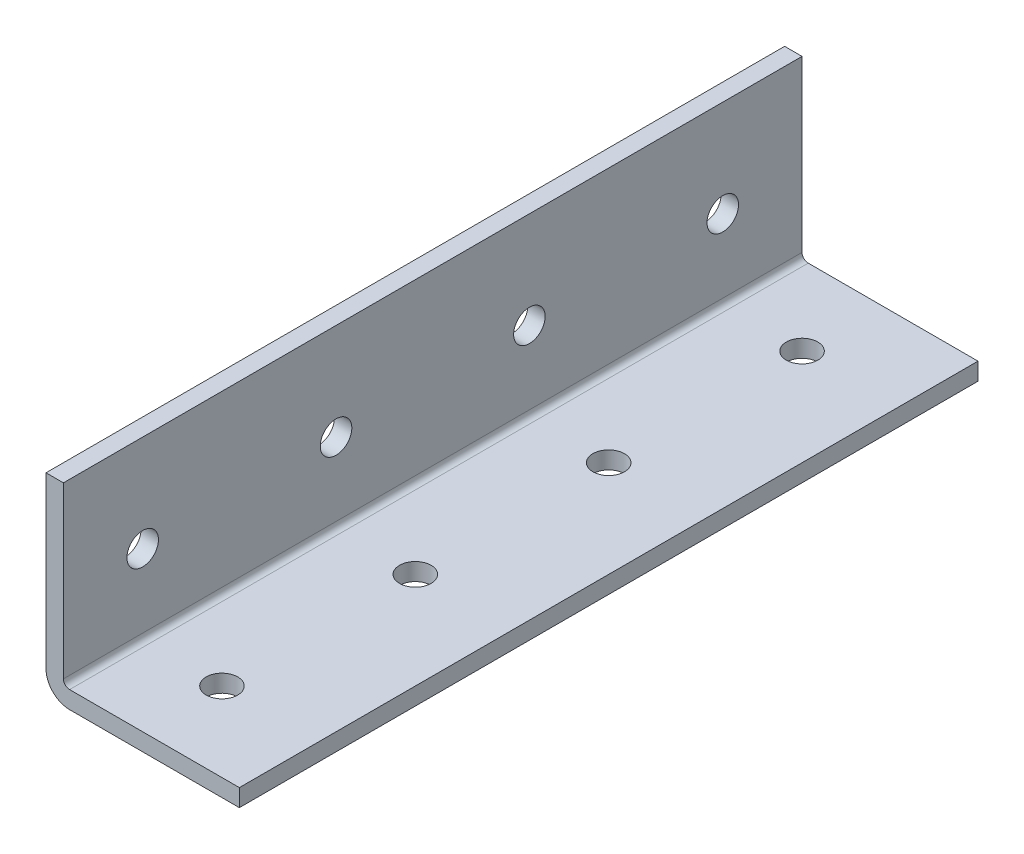
ISO-10303-21;
HEADER;
FILE_DESCRIPTION(('STEP AP214'),'2;1');
FILE_NAME('part.step','',(''),(''),'','','');
FILE_SCHEMA(('AUTOMOTIVE_DESIGN { 1 0 10303 214 1 1 1 1 }'));
ENDSEC;
DATA;
#1=APPLICATION_CONTEXT('core data for automotive mechanical design processes');
#2=APPLICATION_PROTOCOL_DEFINITION('international standard','automotive_design',2000,#1);
#3=PRODUCT_CONTEXT('',#1,'mechanical');
#4=PRODUCT('Part','Part','',(#3));
#5=PRODUCT_RELATED_PRODUCT_CATEGORY('part','',(#4));
#6=PRODUCT_DEFINITION_FORMATION('','',#4);
#7=PRODUCT_DEFINITION_CONTEXT('part definition',#1,'design');
#8=PRODUCT_DEFINITION('design','',#6,#7);
#9=PRODUCT_DEFINITION_SHAPE('','',#8);
#10=(LENGTH_UNIT() NAMED_UNIT(*) SI_UNIT(.MILLI.,.METRE.));
#11=(NAMED_UNIT(*) PLANE_ANGLE_UNIT() SI_UNIT($,.RADIAN.));
#12=(NAMED_UNIT(*) SI_UNIT($,.STERADIAN.) SOLID_ANGLE_UNIT());
#13=UNCERTAINTY_MEASURE_WITH_UNIT(LENGTH_MEASURE(1.E-05),#10,'distance_accuracy_value','');
#14=(GEOMETRIC_REPRESENTATION_CONTEXT(3) GLOBAL_UNCERTAINTY_ASSIGNED_CONTEXT((#13)) GLOBAL_UNIT_ASSIGNED_CONTEXT((#10,
#11,#12)) REPRESENTATION_CONTEXT('',''));
#15=CARTESIAN_POINT('',(0.,0.,0.));
#16=DIRECTION('',(0.,0.,1.));
#17=DIRECTION('',(1.,0.,0.));
#18=AXIS2_PLACEMENT_3D('',#15,#16,#17);
#19=CARTESIAN_POINT('',(25.4,0.,-749.3));
#20=DIRECTION('',(0.,-1.,0.));
#21=DIRECTION('',(0.,0.,-1.));
#22=AXIS2_PLACEMENT_3D('',#19,#20,#21);
#23=PLANE('',#22);
#24=CARTESIAN_POINT('',(12.7,0.,-660.4));
#25=DIRECTION('',(0.,-1.,0.));
#26=DIRECTION('',(0.,0.,-1.));
#27=AXIS2_PLACEMENT_3D('',#24,#25,#26);
#28=CIRCLE('',#27,2.07009999999995);
#29=CARTESIAN_POINT('',(12.7,0.,-662.4701));
#30=VERTEX_POINT('',#29);
#31=EDGE_CURVE('E184',#30,#30,#28,.T.);
#32=ORIENTED_EDGE('',*,*,#31,.F.);
#33=EDGE_LOOP('',(#32));
#34=FACE_BOUND('',#33,.T.);
#35=CARTESIAN_POINT('',(12.7,0.,-685.8));
#36=DIRECTION('',(0.,-1.,0.));
#37=DIRECTION('',(0.,0.,-1.));
#38=AXIS2_PLACEMENT_3D('',#35,#36,#37);
#39=CIRCLE('',#38,2.07009999999995);
#40=CARTESIAN_POINT('',(12.7,0.,-687.8701));
#41=VERTEX_POINT('',#40);
#42=EDGE_CURVE('E178',#41,#41,#39,.T.);
#43=ORIENTED_EDGE('',*,*,#42,.F.);
#44=EDGE_LOOP('',(#43));
#45=FACE_BOUND('',#44,.T.);
#46=CARTESIAN_POINT('',(12.7,0.,-711.2));
#47=DIRECTION('',(0.,-1.,0.));
#48=DIRECTION('',(0.,0.,-1.));
#49=AXIS2_PLACEMENT_3D('',#46,#47,#48);
#50=CIRCLE('',#49,2.07009999999995);
#51=CARTESIAN_POINT('',(12.7,0.,-713.2701));
#52=VERTEX_POINT('',#51);
#53=EDGE_CURVE('E172',#52,#52,#50,.T.);
#54=ORIENTED_EDGE('',*,*,#53,.F.);
#55=EDGE_LOOP('',(#54));
#56=FACE_BOUND('',#55,.T.);
#57=CARTESIAN_POINT('',(12.7,0.,-736.6));
#58=DIRECTION('',(0.,-1.,0.));
#59=DIRECTION('',(0.,0.,-1.));
#60=AXIS2_PLACEMENT_3D('',#57,#58,#59);
#61=CIRCLE('',#60,2.07009999999995);
#62=CARTESIAN_POINT('',(12.7,0.,-738.6701));
#63=VERTEX_POINT('',#62);
#64=EDGE_CURVE('E168',#63,#63,#61,.T.);
#65=ORIENTED_EDGE('',*,*,#64,.F.);
#66=EDGE_LOOP('',(#65));
#67=FACE_BOUND('',#66,.T.);
#68=DIRECTION('',(0.,0.,1.));
#69=VECTOR('',#68,1.);
#70=CARTESIAN_POINT('',(3.0988,0.,-749.3));
#71=LINE('',#70,#69);
#72=CARTESIAN_POINT('',(3.0988,0.,-649.986));
#73=VERTEX_POINT('',#72);
#74=CARTESIAN_POINT('',(3.0988,0.,-747.014));
#75=VERTEX_POINT('',#74);
#76=EDGE_CURVE('E111',#73,#75,#71,.F.);
#77=ORIENTED_EDGE('',*,*,#76,.T.);
#78=DIRECTION('',(1.,0.,0.));
#79=VECTOR('',#78,1.);
#80=CARTESIAN_POINT('',(25.4,0.,-747.014));
#81=LINE('',#80,#79);
#82=CARTESIAN_POINT('',(25.4,0.,-747.014));
#83=VERTEX_POINT('',#82);
#84=EDGE_CURVE('E50',#75,#83,#81,.T.);
#85=ORIENTED_EDGE('',*,*,#84,.T.);
#86=DIRECTION('',(0.,0.,1.));
#87=VECTOR('',#86,1.);
#88=CARTESIAN_POINT('',(25.4,0.,-749.3));
#89=LINE('',#88,#87);
#90=CARTESIAN_POINT('',(25.4,0.,-649.986));
#91=VERTEX_POINT('',#90);
#92=EDGE_CURVE('E127',#83,#91,#89,.T.);
#93=ORIENTED_EDGE('',*,*,#92,.T.);
#94=DIRECTION('',(1.,0.,0.));
#95=VECTOR('',#94,1.);
#96=CARTESIAN_POINT('',(25.4,0.,-649.986));
#97=LINE('',#96,#95);
#98=EDGE_CURVE('E122',#73,#91,#97,.T.);
#99=ORIENTED_EDGE('',*,*,#98,.F.);
#100=EDGE_LOOP('',(#77,#85,#93,#99));
#101=FACE_BOUND('',#100,.T.);
#102=ADVANCED_FACE('F35',(#34,#45,#56,#67,#101),#23,.T.);
#103=CARTESIAN_POINT('',(25.4,25.4,749.3));
#104=DIRECTION('',(0.,1.,0.));
#105=DIRECTION('',(0.,0.,1.));
#106=AXIS2_PLACEMENT_3D('',#103,#104,#105);
#107=PLANE('',#106);
#108=DIRECTION('',(0.,0.,-1.));
#109=VECTOR('',#108,1.);
#110=CARTESIAN_POINT('',(2.286,25.4,749.3));
#111=LINE('',#110,#109);
#112=CARTESIAN_POINT('',(2.286,25.4,-649.986));
#113=VERTEX_POINT('',#112);
#114=CARTESIAN_POINT('',(2.286,25.4,-747.014));
#115=VERTEX_POINT('',#114);
#116=EDGE_CURVE('E191',#113,#115,#111,.T.);
#117=ORIENTED_EDGE('',*,*,#116,.T.);
#118=DIRECTION('',(-1.,0.,0.));
#119=VECTOR('',#118,1.);
#120=CARTESIAN_POINT('',(25.4,25.4,-747.014));
#121=LINE('',#120,#119);
#122=CARTESIAN_POINT('',(0.,25.4000000000002,-747.014));
#123=VERTEX_POINT('',#122);
#124=EDGE_CURVE('E108',#115,#123,#121,.T.);
#125=ORIENTED_EDGE('',*,*,#124,.T.);
#126=DIRECTION('',(0.,0.,-1.));
#127=VECTOR('',#126,1.);
#128=CARTESIAN_POINT('',(0.,25.4,749.3));
#129=LINE('',#128,#127);
#130=CARTESIAN_POINT('',(0.,25.4000000000002,-649.986));
#131=VERTEX_POINT('',#130);
#132=EDGE_CURVE('E107',#131,#123,#129,.T.);
#133=ORIENTED_EDGE('',*,*,#132,.F.);
#134=DIRECTION('',(-1.,0.,0.));
#135=VECTOR('',#134,1.);
#136=CARTESIAN_POINT('',(25.4,25.4,-649.986));
#137=LINE('',#136,#135);
#138=EDGE_CURVE('E129',#113,#131,#137,.T.);
#139=ORIENTED_EDGE('',*,*,#138,.F.);
#140=EDGE_LOOP('',(#117,#125,#133,#139));
#141=FACE_BOUND('',#140,.T.);
#142=ADVANCED_FACE('F221',(#141),#107,.T.);
#143=CARTESIAN_POINT('',(25.4,0.,0.));
#144=DIRECTION('',(-1.,0.,0.));
#145=DIRECTION('',(0.,0.,1.));
#146=AXIS2_PLACEMENT_3D('',#143,#144,#145);
#147=PLANE('',#146);
#148=DIRECTION('',(0.,-1.,0.));
#149=VECTOR('',#148,1.);
#150=CARTESIAN_POINT('',(25.4,0.,-747.014));
#151=LINE('',#150,#149);
#152=CARTESIAN_POINT('',(25.4,2.286,-747.014));
#153=VERTEX_POINT('',#152);
#154=EDGE_CURVE('E213',#153,#83,#151,.T.);
#155=ORIENTED_EDGE('',*,*,#154,.F.);
#156=DIRECTION('',(0.,0.,-1.));
#157=VECTOR('',#156,1.);
#158=CARTESIAN_POINT('',(25.4,2.286,749.3));
#159=LINE('',#158,#157);
#160=CARTESIAN_POINT('',(25.4,2.286,-649.986));
#161=VERTEX_POINT('',#160);
#162=EDGE_CURVE('E190',#161,#153,#159,.T.);
#163=ORIENTED_EDGE('',*,*,#162,.F.);
#164=DIRECTION('',(0.,-1.,0.));
#165=VECTOR('',#164,1.);
#166=CARTESIAN_POINT('',(25.4,0.,-649.986));
#167=LINE('',#166,#165);
#168=EDGE_CURVE('E132',#161,#91,#167,.T.);
#169=ORIENTED_EDGE('',*,*,#168,.T.);
#170=ORIENTED_EDGE('',*,*,#92,.F.);
#171=EDGE_LOOP('',(#155,#163,#169,#170));
#172=FACE_BOUND('',#171,.T.);
#173=ADVANCED_FACE('F229',(#172),#147,.F.);
#174=CARTESIAN_POINT('',(0.,0.,0.));
#175=DIRECTION('',(-1.,0.,0.));
#176=DIRECTION('',(0.,0.,1.));
#177=AXIS2_PLACEMENT_3D('',#174,#175,#176);
#178=PLANE('',#177);
#179=CARTESIAN_POINT('',(0.,12.7,-736.6));
#180=DIRECTION('',(-1.,0.,0.));
#181=DIRECTION('',(0.,0.,1.));
#182=AXIS2_PLACEMENT_3D('',#179,#180,#181);
#183=CIRCLE('',#182,2.07009999999995);
#184=CARTESIAN_POINT('',(0.,12.7,-734.5299));
#185=VERTEX_POINT('',#184);
#186=EDGE_CURVE('E162',#185,#185,#183,.T.);
#187=ORIENTED_EDGE('',*,*,#186,.F.);
#188=EDGE_LOOP('',(#187));
#189=FACE_BOUND('',#188,.T.);
#190=CARTESIAN_POINT('',(0.,12.7,-711.2));
#191=DIRECTION('',(-1.,0.,0.));
#192=DIRECTION('',(0.,0.,1.));
#193=AXIS2_PLACEMENT_3D('',#190,#191,#192);
#194=CIRCLE('',#193,2.07009999999995);
#195=CARTESIAN_POINT('',(0.,12.7,-709.1299));
#196=VERTEX_POINT('',#195);
#197=EDGE_CURVE('E156',#196,#196,#194,.T.);
#198=ORIENTED_EDGE('',*,*,#197,.F.);
#199=EDGE_LOOP('',(#198));
#200=FACE_BOUND('',#199,.T.);
#201=CARTESIAN_POINT('',(0.,12.7,-685.8));
#202=DIRECTION('',(-1.,0.,0.));
#203=DIRECTION('',(0.,0.,1.));
#204=AXIS2_PLACEMENT_3D('',#201,#202,#203);
#205=CIRCLE('',#204,2.07009999999995);
#206=CARTESIAN_POINT('',(0.,12.7,-683.7299));
#207=VERTEX_POINT('',#206);
#208=EDGE_CURVE('E150',#207,#207,#205,.T.);
#209=ORIENTED_EDGE('',*,*,#208,.F.);
#210=EDGE_LOOP('',(#209));
#211=FACE_BOUND('',#210,.T.);
#212=CARTESIAN_POINT('',(0.,12.7,-660.4));
#213=DIRECTION('',(-1.,0.,0.));
#214=DIRECTION('',(0.,0.,1.));
#215=AXIS2_PLACEMENT_3D('',#212,#213,#214);
#216=CIRCLE('',#215,2.07009999999995);
#217=CARTESIAN_POINT('',(0.,12.7,-658.3299));
#218=VERTEX_POINT('',#217);
#219=EDGE_CURVE('E144',#218,#218,#216,.T.);
#220=ORIENTED_EDGE('',*,*,#219,.F.);
#221=EDGE_LOOP('',(#220));
#222=FACE_BOUND('',#221,.T.);
#223=ORIENTED_EDGE('',*,*,#132,.T.);
#224=DIRECTION('',(0.,-1.,0.));
#225=VECTOR('',#224,1.);
#226=CARTESIAN_POINT('',(0.,0.,-747.014));
#227=LINE('',#226,#225);
#228=CARTESIAN_POINT('',(0.,3.0988,-747.014));
#229=VERTEX_POINT('',#228);
#230=EDGE_CURVE('E99',#123,#229,#227,.T.);
#231=ORIENTED_EDGE('',*,*,#230,.T.);
#232=DIRECTION('',(0.,0.,1.));
#233=VECTOR('',#232,1.);
#234=CARTESIAN_POINT('',(0.,3.0988,0.));
#235=LINE('',#234,#233);
#236=CARTESIAN_POINT('',(0.,3.0988,-649.986));
#237=VERTEX_POINT('',#236);
#238=EDGE_CURVE('E57',#229,#237,#235,.T.);
#239=ORIENTED_EDGE('',*,*,#238,.T.);
#240=DIRECTION('',(0.,-1.,0.));
#241=VECTOR('',#240,1.);
#242=CARTESIAN_POINT('',(0.,0.,-649.986));
#243=LINE('',#242,#241);
#244=EDGE_CURVE('E124',#131,#237,#243,.T.);
#245=ORIENTED_EDGE('',*,*,#244,.F.);
#246=EDGE_LOOP('',(#223,#231,#239,#245));
#247=FACE_BOUND('',#246,.T.);
#248=ADVANCED_FACE('F105',(#189,#200,#211,#222,#247),#178,.T.);
#249=CARTESIAN_POINT('',(2.286,2.286,749.3));
#250=DIRECTION('',(-1.,0.,0.));
#251=DIRECTION('',(0.,0.,1.));
#252=AXIS2_PLACEMENT_3D('',#249,#250,#251);
#253=PLANE('',#252);
#254=CARTESIAN_POINT('',(2.286,12.7,-736.6));
#255=DIRECTION('',(-1.,0.,0.));
#256=DIRECTION('',(0.,0.,1.));
#257=AXIS2_PLACEMENT_3D('',#254,#255,#256);
#258=CIRCLE('',#257,2.07009999999995);
#259=CARTESIAN_POINT('',(2.286,12.7,-734.5299));
#260=VERTEX_POINT('',#259);
#261=EDGE_CURVE('E165',#260,#260,#258,.T.);
#262=ORIENTED_EDGE('',*,*,#261,.T.);
#263=EDGE_LOOP('',(#262));
#264=FACE_BOUND('',#263,.T.);
#265=CARTESIAN_POINT('',(2.286,12.7,-711.2));
#266=DIRECTION('',(-1.,0.,0.));
#267=DIRECTION('',(0.,0.,1.));
#268=AXIS2_PLACEMENT_3D('',#265,#266,#267);
#269=CIRCLE('',#268,2.07009999999995);
#270=CARTESIAN_POINT('',(2.286,12.7,-709.1299));
#271=VERTEX_POINT('',#270);
#272=EDGE_CURVE('E159',#271,#271,#269,.T.);
#273=ORIENTED_EDGE('',*,*,#272,.T.);
#274=EDGE_LOOP('',(#273));
#275=FACE_BOUND('',#274,.T.);
#276=CARTESIAN_POINT('',(2.286,12.7,-685.8));
#277=DIRECTION('',(-1.,0.,0.));
#278=DIRECTION('',(0.,0.,1.));
#279=AXIS2_PLACEMENT_3D('',#276,#277,#278);
#280=CIRCLE('',#279,2.07009999999995);
#281=CARTESIAN_POINT('',(2.286,12.7,-683.7299));
#282=VERTEX_POINT('',#281);
#283=EDGE_CURVE('E153',#282,#282,#280,.T.);
#284=ORIENTED_EDGE('',*,*,#283,.T.);
#285=EDGE_LOOP('',(#284));
#286=FACE_BOUND('',#285,.T.);
#287=CARTESIAN_POINT('',(2.286,12.7,-660.4));
#288=DIRECTION('',(-1.,0.,0.));
#289=DIRECTION('',(0.,0.,1.));
#290=AXIS2_PLACEMENT_3D('',#287,#288,#289);
#291=CIRCLE('',#290,2.07009999999995);
#292=CARTESIAN_POINT('',(2.286,12.7,-658.3299));
#293=VERTEX_POINT('',#292);
#294=EDGE_CURVE('E147',#293,#293,#291,.T.);
#295=ORIENTED_EDGE('',*,*,#294,.T.);
#296=EDGE_LOOP('',(#295));
#297=FACE_BOUND('',#296,.T.);
#298=DIRECTION('',(0.,-1.,0.));
#299=VECTOR('',#298,1.);
#300=CARTESIAN_POINT('',(2.286,2.286,-747.014));
#301=LINE('',#300,#299);
#302=CARTESIAN_POINT('',(2.286,3.0988,-747.014));
#303=VERTEX_POINT('',#302);
#304=EDGE_CURVE('E205',#115,#303,#301,.T.);
#305=ORIENTED_EDGE('',*,*,#304,.F.);
#306=ORIENTED_EDGE('',*,*,#116,.F.);
#307=DIRECTION('',(0.,-1.,0.));
#308=VECTOR('',#307,1.);
#309=CARTESIAN_POINT('',(2.286,2.286,-649.986));
#310=LINE('',#309,#308);
#311=CARTESIAN_POINT('',(2.286,3.0988,-649.986));
#312=VERTEX_POINT('',#311);
#313=EDGE_CURVE('E128',#113,#312,#310,.T.);
#314=ORIENTED_EDGE('',*,*,#313,.T.);
#315=DIRECTION('',(0.,0.,-1.));
#316=VECTOR('',#315,1.);
#317=CARTESIAN_POINT('',(2.286,3.0988,-749.3));
#318=LINE('',#317,#316);
#319=EDGE_CURVE('E115',#312,#303,#318,.T.);
#320=ORIENTED_EDGE('',*,*,#319,.T.);
#321=EDGE_LOOP('',(#305,#306,#314,#320));
#322=FACE_BOUND('',#321,.T.);
#323=ADVANCED_FACE('F203',(#264,#275,#286,#297,#322),#253,.F.);
#324=CARTESIAN_POINT('',(25.4,2.286,749.3));
#325=DIRECTION('',(0.,-1.,0.));
#326=DIRECTION('',(0.,0.,-1.));
#327=AXIS2_PLACEMENT_3D('',#324,#325,#326);
#328=PLANE('',#327);
#329=CARTESIAN_POINT('',(12.7,2.286,-660.4));
#330=DIRECTION('',(0.,-1.,0.));
#331=DIRECTION('',(0.,0.,-1.));
#332=AXIS2_PLACEMENT_3D('',#329,#330,#331);
#333=CIRCLE('',#332,2.07009999999995);
#334=CARTESIAN_POINT('',(12.7,2.286,-662.4701));
#335=VERTEX_POINT('',#334);
#336=EDGE_CURVE('E187',#335,#335,#333,.T.);
#337=ORIENTED_EDGE('',*,*,#336,.T.);
#338=EDGE_LOOP('',(#337));
#339=FACE_BOUND('',#338,.T.);
#340=CARTESIAN_POINT('',(12.7,2.286,-685.8));
#341=DIRECTION('',(0.,-1.,0.));
#342=DIRECTION('',(0.,0.,-1.));
#343=AXIS2_PLACEMENT_3D('',#340,#341,#342);
#344=CIRCLE('',#343,2.07009999999995);
#345=CARTESIAN_POINT('',(12.7,2.286,-687.8701));
#346=VERTEX_POINT('',#345);
#347=EDGE_CURVE('E181',#346,#346,#344,.T.);
#348=ORIENTED_EDGE('',*,*,#347,.T.);
#349=EDGE_LOOP('',(#348));
#350=FACE_BOUND('',#349,.T.);
#351=CARTESIAN_POINT('',(12.7,2.286,-711.2));
#352=DIRECTION('',(0.,-1.,0.));
#353=DIRECTION('',(0.,0.,-1.));
#354=AXIS2_PLACEMENT_3D('',#351,#352,#353);
#355=CIRCLE('',#354,2.07009999999995);
#356=CARTESIAN_POINT('',(12.7,2.286,-713.2701));
#357=VERTEX_POINT('',#356);
#358=EDGE_CURVE('E175',#357,#357,#355,.T.);
#359=ORIENTED_EDGE('',*,*,#358,.T.);
#360=EDGE_LOOP('',(#359));
#361=FACE_BOUND('',#360,.T.);
#362=CARTESIAN_POINT('',(12.7,2.286,-736.6));
#363=DIRECTION('',(0.,-1.,0.));
#364=DIRECTION('',(0.,0.,-1.));
#365=AXIS2_PLACEMENT_3D('',#362,#363,#364);
#366=CIRCLE('',#365,2.07009999999995);
#367=CARTESIAN_POINT('',(12.7,2.286,-738.6701));
#368=VERTEX_POINT('',#367);
#369=EDGE_CURVE('E171',#368,#368,#366,.T.);
#370=ORIENTED_EDGE('',*,*,#369,.T.);
#371=EDGE_LOOP('',(#370));
#372=FACE_BOUND('',#371,.T.);
#373=DIRECTION('',(1.,0.,0.));
#374=VECTOR('',#373,1.);
#375=CARTESIAN_POINT('',(25.4,2.286,-747.014));
#376=LINE('',#375,#374);
#377=CARTESIAN_POINT('',(3.0988,2.286,-747.014));
#378=VERTEX_POINT('',#377);
#379=EDGE_CURVE('E212',#378,#153,#376,.T.);
#380=ORIENTED_EDGE('',*,*,#379,.F.);
#381=DIRECTION('',(0.,0.,-1.));
#382=VECTOR('',#381,1.);
#383=CARTESIAN_POINT('',(3.0988,2.286,749.3));
#384=LINE('',#383,#382);
#385=CARTESIAN_POINT('',(3.0988,2.286,-649.986));
#386=VERTEX_POINT('',#385);
#387=EDGE_CURVE('E112',#378,#386,#384,.F.);
#388=ORIENTED_EDGE('',*,*,#387,.T.);
#389=DIRECTION('',(1.,0.,0.));
#390=VECTOR('',#389,1.);
#391=CARTESIAN_POINT('',(25.4,2.286,-649.986));
#392=LINE('',#391,#390);
#393=EDGE_CURVE('E141',#386,#161,#392,.T.);
#394=ORIENTED_EDGE('',*,*,#393,.T.);
#395=ORIENTED_EDGE('',*,*,#162,.T.);
#396=EDGE_LOOP('',(#380,#388,#394,#395));
#397=FACE_BOUND('',#396,.T.);
#398=ADVANCED_FACE('F226',(#339,#350,#361,#372,#397),#328,.F.);
#399=CARTESIAN_POINT('',(3.0988,3.0988,749.3));
#400=DIRECTION('',(0.,0.,1.));
#401=DIRECTION('',(1.,0.,0.));
#402=AXIS2_PLACEMENT_3D('',#399,#400,#401);
#403=CYLINDRICAL_SURFACE('',#402,0.8128);
#404=CARTESIAN_POINT('',(3.0988,3.0988,-747.014));
#405=DIRECTION('',(0.,0.,-1.));
#406=DIRECTION('',(-1.,0.,0.));
#407=AXIS2_PLACEMENT_3D('',#404,#405,#406);
#408=CIRCLE('',#407,0.8128);
#409=EDGE_CURVE('E210',#303,#378,#408,.F.);
#410=ORIENTED_EDGE('',*,*,#409,.F.);
#411=ORIENTED_EDGE('',*,*,#319,.F.);
#412=CARTESIAN_POINT('',(3.0988,3.0988,-649.986));
#413=DIRECTION('',(0.,0.,-1.));
#414=DIRECTION('',(-1.,0.,0.));
#415=AXIS2_PLACEMENT_3D('',#412,#413,#414);
#416=CIRCLE('',#415,0.8128);
#417=EDGE_CURVE('E138',#312,#386,#416,.F.);
#418=ORIENTED_EDGE('',*,*,#417,.T.);
#419=ORIENTED_EDGE('',*,*,#387,.F.);
#420=EDGE_LOOP('',(#410,#411,#418,#419));
#421=FACE_BOUND('',#420,.T.);
#422=ADVANCED_FACE('F208',(#421),#403,.F.);
#423=CARTESIAN_POINT('',(3.0988,3.0988,0.));
#424=DIRECTION('',(0.,0.,1.));
#425=DIRECTION('',(1.,0.,0.));
#426=AXIS2_PLACEMENT_3D('',#423,#424,#425);
#427=CYLINDRICAL_SURFACE('',#426,3.0988);
#428=ORIENTED_EDGE('',*,*,#238,.F.);
#429=CARTESIAN_POINT('',(3.0988,3.0988,-747.014));
#430=DIRECTION('',(0.,0.,-1.));
#431=DIRECTION('',(-1.,0.,0.));
#432=AXIS2_PLACEMENT_3D('',#429,#430,#431);
#433=CIRCLE('',#432,3.0988);
#434=EDGE_CURVE('E11',#229,#75,#433,.F.);
#435=ORIENTED_EDGE('',*,*,#434,.T.);
#436=ORIENTED_EDGE('',*,*,#76,.F.);
#437=CARTESIAN_POINT('',(3.0988,3.0988,-649.986));
#438=DIRECTION('',(0.,0.,-1.));
#439=DIRECTION('',(-1.,0.,0.));
#440=AXIS2_PLACEMENT_3D('',#437,#438,#439);
#441=CIRCLE('',#440,3.0988);
#442=EDGE_CURVE('E43',#237,#73,#441,.F.);
#443=ORIENTED_EDGE('',*,*,#442,.F.);
#444=EDGE_LOOP('',(#428,#435,#436,#443));
#445=FACE_BOUND('',#444,.T.);
#446=ADVANCED_FACE('F37',(#445),#427,.T.);
#447=CARTESIAN_POINT('',(12.7,0.,-660.4));
#448=DIRECTION('',(0.,-1.,0.));
#449=DIRECTION('',(0.,0.,-1.));
#450=AXIS2_PLACEMENT_3D('',#447,#448,#449);
#451=CYLINDRICAL_SURFACE('',#450,2.07009999999995);
#452=ORIENTED_EDGE('',*,*,#31,.T.);
#453=EDGE_LOOP('',(#452));
#454=FACE_BOUND('',#453,.T.);
#455=ORIENTED_EDGE('',*,*,#336,.F.);
#456=EDGE_LOOP('',(#455));
#457=FACE_BOUND('',#456,.T.);
#458=ADVANCED_FACE('F253',(#454,#457),#451,.F.);
#459=CARTESIAN_POINT('',(12.7,0.,-685.8));
#460=DIRECTION('',(0.,-1.,0.));
#461=DIRECTION('',(0.,0.,-1.));
#462=AXIS2_PLACEMENT_3D('',#459,#460,#461);
#463=CYLINDRICAL_SURFACE('',#462,2.07009999999995);
#464=ORIENTED_EDGE('',*,*,#42,.T.);
#465=EDGE_LOOP('',(#464));
#466=FACE_BOUND('',#465,.T.);
#467=ORIENTED_EDGE('',*,*,#347,.F.);
#468=EDGE_LOOP('',(#467));
#469=FACE_BOUND('',#468,.T.);
#470=ADVANCED_FACE('F264',(#466,#469),#463,.F.);
#471=CARTESIAN_POINT('',(12.7,0.,-711.2));
#472=DIRECTION('',(0.,-1.,0.));
#473=DIRECTION('',(0.,0.,-1.));
#474=AXIS2_PLACEMENT_3D('',#471,#472,#473);
#475=CYLINDRICAL_SURFACE('',#474,2.07009999999995);
#476=ORIENTED_EDGE('',*,*,#53,.T.);
#477=EDGE_LOOP('',(#476));
#478=FACE_BOUND('',#477,.T.);
#479=ORIENTED_EDGE('',*,*,#358,.F.);
#480=EDGE_LOOP('',(#479));
#481=FACE_BOUND('',#480,.T.);
#482=ADVANCED_FACE('F268',(#478,#481),#475,.F.);
#483=CARTESIAN_POINT('',(12.7,0.,-736.6));
#484=DIRECTION('',(0.,-1.,0.));
#485=DIRECTION('',(0.,0.,-1.));
#486=AXIS2_PLACEMENT_3D('',#483,#484,#485);
#487=CYLINDRICAL_SURFACE('',#486,2.07009999999995);
#488=ORIENTED_EDGE('',*,*,#64,.T.);
#489=EDGE_LOOP('',(#488));
#490=FACE_BOUND('',#489,.T.);
#491=ORIENTED_EDGE('',*,*,#369,.F.);
#492=EDGE_LOOP('',(#491));
#493=FACE_BOUND('',#492,.T.);
#494=ADVANCED_FACE('F272',(#490,#493),#487,.F.);
#495=CARTESIAN_POINT('',(0.,12.7,-736.6));
#496=DIRECTION('',(-1.,0.,0.));
#497=DIRECTION('',(0.,0.,1.));
#498=AXIS2_PLACEMENT_3D('',#495,#496,#497);
#499=CYLINDRICAL_SURFACE('',#498,2.07009999999995);
#500=ORIENTED_EDGE('',*,*,#186,.T.);
#501=EDGE_LOOP('',(#500));
#502=FACE_BOUND('',#501,.T.);
#503=ORIENTED_EDGE('',*,*,#261,.F.);
#504=EDGE_LOOP('',(#503));
#505=FACE_BOUND('',#504,.T.);
#506=ADVANCED_FACE('F276',(#502,#505),#499,.F.);
#507=CARTESIAN_POINT('',(0.,12.7,-711.2));
#508=DIRECTION('',(-1.,0.,0.));
#509=DIRECTION('',(0.,0.,1.));
#510=AXIS2_PLACEMENT_3D('',#507,#508,#509);
#511=CYLINDRICAL_SURFACE('',#510,2.07009999999995);
#512=ORIENTED_EDGE('',*,*,#197,.T.);
#513=EDGE_LOOP('',(#512));
#514=FACE_BOUND('',#513,.T.);
#515=ORIENTED_EDGE('',*,*,#272,.F.);
#516=EDGE_LOOP('',(#515));
#517=FACE_BOUND('',#516,.T.);
#518=ADVANCED_FACE('F280',(#514,#517),#511,.F.);
#519=CARTESIAN_POINT('',(0.,12.7,-685.8));
#520=DIRECTION('',(-1.,0.,0.));
#521=DIRECTION('',(0.,0.,1.));
#522=AXIS2_PLACEMENT_3D('',#519,#520,#521);
#523=CYLINDRICAL_SURFACE('',#522,2.07009999999995);
#524=ORIENTED_EDGE('',*,*,#208,.T.);
#525=EDGE_LOOP('',(#524));
#526=FACE_BOUND('',#525,.T.);
#527=ORIENTED_EDGE('',*,*,#283,.F.);
#528=EDGE_LOOP('',(#527));
#529=FACE_BOUND('',#528,.T.);
#530=ADVANCED_FACE('F284',(#526,#529),#523,.F.);
#531=CARTESIAN_POINT('',(0.,12.7,-660.4));
#532=DIRECTION('',(-1.,0.,0.));
#533=DIRECTION('',(0.,0.,1.));
#534=AXIS2_PLACEMENT_3D('',#531,#532,#533);
#535=CYLINDRICAL_SURFACE('',#534,2.07009999999995);
#536=ORIENTED_EDGE('',*,*,#219,.T.);
#537=EDGE_LOOP('',(#536));
#538=FACE_BOUND('',#537,.T.);
#539=ORIENTED_EDGE('',*,*,#294,.F.);
#540=EDGE_LOOP('',(#539));
#541=FACE_BOUND('',#540,.T.);
#542=ADVANCED_FACE('F288',(#538,#541),#535,.F.);
#543=CARTESIAN_POINT('',(0.,0.,-649.986));
#544=DIRECTION('',(0.,0.,-1.));
#545=DIRECTION('',(-1.,0.,0.));
#546=AXIS2_PLACEMENT_3D('',#543,#544,#545);
#547=PLANE('',#546);
#548=ORIENTED_EDGE('',*,*,#417,.F.);
#549=ORIENTED_EDGE('',*,*,#313,.F.);
#550=ORIENTED_EDGE('',*,*,#138,.T.);
#551=ORIENTED_EDGE('',*,*,#244,.T.);
#552=ORIENTED_EDGE('',*,*,#442,.T.);
#553=ORIENTED_EDGE('',*,*,#98,.T.);
#554=ORIENTED_EDGE('',*,*,#168,.F.);
#555=ORIENTED_EDGE('',*,*,#393,.F.);
#556=EDGE_LOOP('',(#548,#549,#550,#551,#552,#553,#554,#555));
#557=FACE_BOUND('',#556,.T.);
#558=ADVANCED_FACE('F121',(#557),#547,.F.);
#559=CARTESIAN_POINT('',(0.,0.,-747.014));
#560=DIRECTION('',(0.,0.,-1.));
#561=DIRECTION('',(-1.,0.,0.));
#562=AXIS2_PLACEMENT_3D('',#559,#560,#561);
#563=PLANE('',#562);
#564=ORIENTED_EDGE('',*,*,#379,.T.);
#565=ORIENTED_EDGE('',*,*,#154,.T.);
#566=ORIENTED_EDGE('',*,*,#84,.F.);
#567=ORIENTED_EDGE('',*,*,#434,.F.);
#568=ORIENTED_EDGE('',*,*,#230,.F.);
#569=ORIENTED_EDGE('',*,*,#124,.F.);
#570=ORIENTED_EDGE('',*,*,#304,.T.);
#571=ORIENTED_EDGE('',*,*,#409,.T.);
#572=EDGE_LOOP('',(#564,#565,#566,#567,#568,#569,#570,#571));
#573=FACE_BOUND('',#572,.T.);
#574=ADVANCED_FACE('F98',(#573),#563,.T.);
#575=CLOSED_SHELL('',(#102,#142,#173,#248,#323,#398,#422,#446,#458,#470,#482,#494,#506,#518,
#530,#542,#558,#574));
#576=MANIFOLD_SOLID_BREP('B2',#575);
#577=ADVANCED_BREP_SHAPE_REPRESENTATION('',(#18,#576),#14);
#578=SHAPE_DEFINITION_REPRESENTATION(#9,#577);
ENDSEC;
END-ISO-10303-21;
